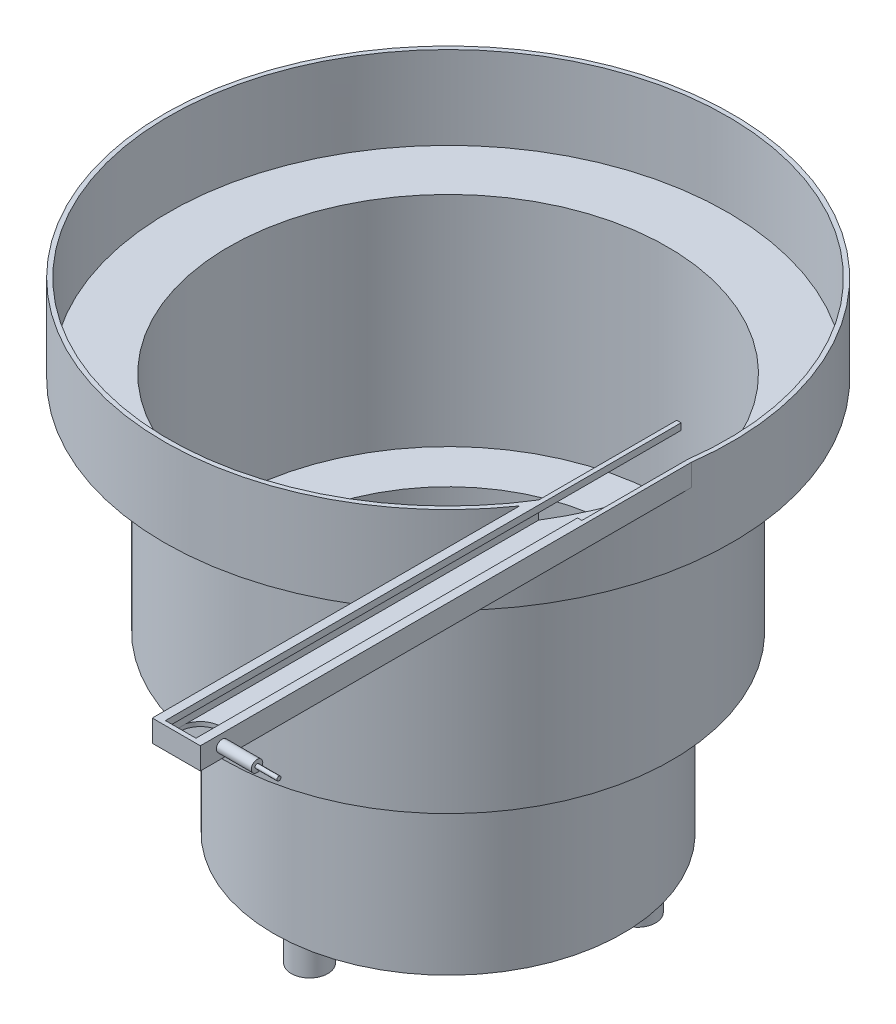
ISO-10303-21;
HEADER;
FILE_DESCRIPTION(('STEP AP214'),'2;1');
FILE_NAME('part.step','',(''),(''),'','','');
FILE_SCHEMA(('AUTOMOTIVE_DESIGN { 1 0 10303 214 1 1 1 1 }'));
ENDSEC;
DATA;
#1=APPLICATION_CONTEXT('core data for automotive mechanical design processes');
#2=APPLICATION_PROTOCOL_DEFINITION('international standard','automotive_design',2000,#1);
#3=PRODUCT_CONTEXT('',#1,'mechanical');
#4=PRODUCT('Part','Part','',(#3));
#5=PRODUCT_RELATED_PRODUCT_CATEGORY('part','',(#4));
#6=PRODUCT_DEFINITION_FORMATION('','',#4);
#7=PRODUCT_DEFINITION_CONTEXT('part definition',#1,'design');
#8=PRODUCT_DEFINITION('design','',#6,#7);
#9=PRODUCT_DEFINITION_SHAPE('','',#8);
#10=(LENGTH_UNIT() NAMED_UNIT(*) SI_UNIT(.MILLI.,.METRE.));
#11=(NAMED_UNIT(*) PLANE_ANGLE_UNIT() SI_UNIT($,.RADIAN.));
#12=(NAMED_UNIT(*) SI_UNIT($,.STERADIAN.) SOLID_ANGLE_UNIT());
#13=UNCERTAINTY_MEASURE_WITH_UNIT(LENGTH_MEASURE(1.E-05),#10,'distance_accuracy_value','');
#14=(GEOMETRIC_REPRESENTATION_CONTEXT(3) GLOBAL_UNCERTAINTY_ASSIGNED_CONTEXT((#13)) GLOBAL_UNIT_ASSIGNED_CONTEXT((#10,
#11,#12)) REPRESENTATION_CONTEXT('',''));
#15=CARTESIAN_POINT('',(0.,0.,0.));
#16=DIRECTION('',(0.,0.,1.));
#17=DIRECTION('',(1.,0.,0.));
#18=AXIS2_PLACEMENT_3D('',#15,#16,#17);
#19=CARTESIAN_POINT('',(144.842090500048,214.997371461664,232.319143826345));
#20=DIRECTION('',(1.,0.,0.));
#21=DIRECTION('',(0.,0.,-1.));
#22=AXIS2_PLACEMENT_3D('',#19,#20,#21);
#23=PLANE('',#22);
#24=CARTESIAN_POINT('',(144.842090500048,214.997371461664,232.319143826345));
#25=DIRECTION('',(1.,0.,0.));
#26=DIRECTION('',(0.,0.,-1.));
#27=AXIS2_PLACEMENT_3D('',#24,#25,#26);
#28=CIRCLE('',#27,2.6133198852535);
#29=CARTESIAN_POINT('',(144.842090500048,214.997371461664,229.705823941092));
#30=VERTEX_POINT('',#29);
#31=EDGE_CURVE('E179',#30,#30,#28,.T.);
#32=ORIENTED_EDGE('',*,*,#31,.T.);
#33=EDGE_LOOP('',(#32));
#34=FACE_BOUND('',#33,.T.);
#35=CARTESIAN_POINT('',(144.842090500048,214.997371461664,232.319143826345));
#36=DIRECTION('',(1.,0.,0.));
#37=DIRECTION('',(0.,0.,-1.));
#38=AXIS2_PLACEMENT_3D('',#35,#36,#37);
#39=CIRCLE('',#38,0.94118360123812);
#40=CARTESIAN_POINT('',(144.842090500048,214.997371461664,231.377960225107));
#41=VERTEX_POINT('',#40);
#42=EDGE_CURVE('E486',#41,#41,#39,.T.);
#43=ORIENTED_EDGE('',*,*,#42,.F.);
#44=EDGE_LOOP('',(#43));
#45=FACE_BOUND('',#44,.T.);
#46=ADVANCED_FACE('F38',(#34,#45),#23,.T.);
#47=CARTESIAN_POINT('',(128.842090500048,210.,1.44581984546799));
#48=DIRECTION('',(1.,0.,0.));
#49=DIRECTION('',(0.,0.,-1.));
#50=AXIS2_PLACEMENT_3D('',#47,#48,#49);
#51=PLANE('',#50);
#52=DIRECTION('',(0.,0.,-1.));
#53=VECTOR('',#52,1.);
#54=CARTESIAN_POINT('',(128.842090500048,220.,1.44581984546799));
#55=LINE('',#54,#53);
#56=CARTESIAN_POINT('',(128.842090500048,220.,242.28655443066));
#57=VERTEX_POINT('',#56);
#58=CARTESIAN_POINT('',(128.842090500048,220.,17.3122995462015));
#59=VERTEX_POINT('',#58);
#60=EDGE_CURVE('E222',#57,#59,#55,.T.);
#61=ORIENTED_EDGE('',*,*,#60,.F.);
#62=DIRECTION('',(0.,1.,0.));
#63=VECTOR('',#62,1.);
#64=CARTESIAN_POINT('',(128.842090500048,220.,242.28655443066));
#65=LINE('',#64,#63);
#66=CARTESIAN_POINT('',(128.842090500048,210.,242.28655443066));
#67=VERTEX_POINT('',#66);
#68=EDGE_CURVE('E341',#67,#57,#65,.T.);
#69=ORIENTED_EDGE('',*,*,#68,.F.);
#70=DIRECTION('',(0.,0.,-1.));
#71=VECTOR('',#70,1.);
#72=CARTESIAN_POINT('',(128.842090500048,210.,1.44581984546799));
#73=LINE('',#72,#71);
#74=CARTESIAN_POINT('',(128.842090500048,210.,17.3122995462015));
#75=VERTEX_POINT('',#74);
#76=EDGE_CURVE('E216',#67,#75,#73,.T.);
#77=ORIENTED_EDGE('',*,*,#76,.T.);
#78=DIRECTION('',(0.,-1.,0.));
#79=VECTOR('',#78,1.);
#80=CARTESIAN_POINT('',(128.842090500048,220.,17.3122995462015));
#81=LINE('',#80,#79);
#82=EDGE_CURVE('E228',#59,#75,#81,.T.);
#83=ORIENTED_EDGE('',*,*,#82,.F.);
#84=EDGE_LOOP('',(#61,#69,#77,#83));
#85=FACE_BOUND('',#84,.T.);
#86=CARTESIAN_POINT('',(128.842090500048,214.997371461664,232.319143826345));
#87=DIRECTION('',(1.,0.,0.));
#88=DIRECTION('',(0.,0.,-1.));
#89=AXIS2_PLACEMENT_3D('',#86,#87,#88);
#90=CIRCLE('',#89,2.6133198852535);
#91=CARTESIAN_POINT('',(128.842090500048,214.997371461664,229.705823941092));
#92=VERTEX_POINT('',#91);
#93=EDGE_CURVE('E481',#92,#92,#90,.T.);
#94=ORIENTED_EDGE('',*,*,#93,.F.);
#95=EDGE_LOOP('',(#94));
#96=FACE_BOUND('',#95,.T.);
#97=ADVANCED_FACE('F387',(#85,#96),#51,.T.);
#98=CARTESIAN_POINT('',(0.,212.,0.));
#99=DIRECTION('',(0.,-1.,0.));
#100=DIRECTION('',(0.,0.,-1.));
#101=AXIS2_PLACEMENT_3D('',#98,#99,#100);
#102=PLANE('',#101);
#103=DIRECTION('',(0.,0.,-1.));
#104=VECTOR('',#103,1.);
#105=CARTESIAN_POINT('',(126.842090500048,212.,1.44581984546799));
#106=LINE('',#105,#104);
#107=CARTESIAN_POINT('',(126.842090500048,212.,240.28655443066));
#108=VERTEX_POINT('',#107);
#109=CARTESIAN_POINT('',(126.842090500048,212.,233.845458790749));
#110=VERTEX_POINT('',#109);
#111=EDGE_CURVE('E185',#108,#110,#106,.T.);
#112=ORIENTED_EDGE('',*,*,#111,.T.);
#113=CARTESIAN_POINT('',(117.842090500048,212.,231.28655443066));
#114=DIRECTION('',(0.,1.,0.));
#115=DIRECTION('',(0.,0.,1.));
#116=AXIS2_PLACEMENT_3D('',#113,#114,#115);
#117=CIRCLE('',#116,9.35670837015266);
#118=CARTESIAN_POINT('',(120.400994860137,212.,240.28655443066));
#119=VERTEX_POINT('',#118);
#120=EDGE_CURVE('E177',#119,#110,#117,.T.);
#121=ORIENTED_EDGE('',*,*,#120,.F.);
#122=DIRECTION('',(1.,0.,0.));
#123=VECTOR('',#122,1.);
#124=CARTESIAN_POINT('',(128.842090500048,212.,240.28655443066));
#125=LINE('',#124,#123);
#126=EDGE_CURVE('E171',#119,#108,#125,.T.);
#127=ORIENTED_EDGE('',*,*,#126,.T.);
#128=EDGE_LOOP('',(#112,#121,#127));
#129=FACE_BOUND('',#128,.T.);
#130=ADVANCED_FACE('F183',(#129),#102,.F.);
#131=CARTESIAN_POINT('',(108.842090500048,212.,240.28655443066));
#132=VERTEX_POINT('',#131);
#133=CARTESIAN_POINT('',(115.283186139959,212.,240.28655443066));
#134=VERTEX_POINT('',#133);
#135=EDGE_CURVE('E170',#132,#134,#125,.T.);
#136=ORIENTED_EDGE('',*,*,#135,.T.);
#137=CARTESIAN_POINT('',(108.842090500048,212.,233.845458790749));
#138=VERTEX_POINT('',#137);
#139=EDGE_CURVE('E55',#138,#134,#117,.T.);
#140=ORIENTED_EDGE('',*,*,#139,.F.);
#141=DIRECTION('',(0.,0.,1.));
#142=VECTOR('',#141,1.);
#143=CARTESIAN_POINT('',(108.842090500048,212.,1.44581984546799));
#144=LINE('',#143,#142);
#145=EDGE_CURVE('E195',#138,#132,#144,.T.);
#146=ORIENTED_EDGE('',*,*,#145,.T.);
#147=EDGE_LOOP('',(#136,#140,#146));
#148=FACE_BOUND('',#147,.T.);
#149=ADVANCED_FACE('F593',(#148),#102,.F.);
#150=CARTESIAN_POINT('',(0.,0.,0.));
#151=DIRECTION('',(0.,1.,0.));
#152=DIRECTION('',(0.,0.,1.));
#153=AXIS2_PLACEMENT_3D('',#150,#151,#152);
#154=PLANE('',#153);
#155=CARTESIAN_POINT('',(-54.9316198527615,0.,-31.7147855090144));
#156=DIRECTION('',(0.,1.,0.));
#157=DIRECTION('',(0.,0.,1.));
#158=AXIS2_PLACEMENT_3D('',#155,#156,#157);
#159=CIRCLE('',#158,8.39932946770995);
#160=CARTESIAN_POINT('',(-54.9316198527615,0.,-23.3154560413045));
#161=VERTEX_POINT('',#160);
#162=EDGE_CURVE('E47',#161,#161,#159,.F.);
#163=ORIENTED_EDGE('',*,*,#162,.F.);
#164=EDGE_LOOP('',(#163));
#165=FACE_BOUND('',#164,.T.);
#166=CARTESIAN_POINT('',(0.,0.,0.));
#167=DIRECTION('',(0.,1.,0.));
#168=DIRECTION('',(0.,0.,1.));
#169=AXIS2_PLACEMENT_3D('',#166,#167,#168);
#170=CIRCLE('',#169,80.);
#171=CARTESIAN_POINT('',(0.,0.,80.));
#172=VERTEX_POINT('',#171);
#173=EDGE_CURVE('E241',#172,#172,#170,.T.);
#174=ORIENTED_EDGE('',*,*,#173,.F.);
#175=EDGE_LOOP('',(#174));
#176=FACE_BOUND('',#175,.T.);
#177=CARTESIAN_POINT('',(0.,0.,63.4295710180283));
#178=DIRECTION('',(0.,1.,0.));
#179=DIRECTION('',(0.,0.,1.));
#180=AXIS2_PLACEMENT_3D('',#177,#178,#179);
#181=CIRCLE('',#180,8.39932946770995);
#182=CARTESIAN_POINT('',(0.,0.,71.8289004857382));
#183=VERTEX_POINT('',#182);
#184=EDGE_CURVE('E252',#183,#183,#181,.F.);
#185=ORIENTED_EDGE('',*,*,#184,.F.);
#186=EDGE_LOOP('',(#185));
#187=FACE_BOUND('',#186,.T.);
#188=CARTESIAN_POINT('',(54.931619852762,0.,-31.7147855090136));
#189=DIRECTION('',(0.,1.,0.));
#190=DIRECTION('',(0.,0.,1.));
#191=AXIS2_PLACEMENT_3D('',#188,#189,#190);
#192=CIRCLE('',#191,8.39932946770995);
#193=CARTESIAN_POINT('',(54.931619852762,0.,-23.3154560413037));
#194=VERTEX_POINT('',#193);
#195=EDGE_CURVE('E11',#194,#194,#192,.F.);
#196=ORIENTED_EDGE('',*,*,#195,.F.);
#197=EDGE_LOOP('',(#196));
#198=FACE_BOUND('',#197,.T.);
#199=ADVANCED_FACE('F616',(#165,#176,#187,#198),#154,.F.);
#200=CARTESIAN_POINT('',(0.,80.,0.));
#201=DIRECTION('',(0.,-1.,0.));
#202=DIRECTION('',(0.,0.,-1.));
#203=AXIS2_PLACEMENT_3D('',#200,#201,#202);
#204=CYLINDRICAL_SURFACE('',#203,80.);
#205=CARTESIAN_POINT('',(0.,80.,0.));
#206=DIRECTION('',(0.,1.,0.));
#207=DIRECTION('',(0.,0.,1.));
#208=AXIS2_PLACEMENT_3D('',#205,#206,#207);
#209=CIRCLE('',#208,80.);
#210=CARTESIAN_POINT('',(0.,80.,80.));
#211=VERTEX_POINT('',#210);
#212=EDGE_CURVE('E244',#211,#211,#209,.T.);
#213=ORIENTED_EDGE('',*,*,#212,.F.);
#214=EDGE_LOOP('',(#213));
#215=FACE_BOUND('',#214,.T.);
#216=ORIENTED_EDGE('',*,*,#173,.T.);
#217=EDGE_LOOP('',(#216));
#218=FACE_BOUND('',#217,.T.);
#219=ADVANCED_FACE('F40',(#215,#218),#204,.T.);
#220=CARTESIAN_POINT('',(0.,80.,0.));
#221=DIRECTION('',(0.,1.,0.));
#222=DIRECTION('',(0.,0.,1.));
#223=AXIS2_PLACEMENT_3D('',#220,#221,#222);
#224=PLANE('',#223);
#225=CARTESIAN_POINT('',(0.,80.,0.));
#226=DIRECTION('',(0.,1.,0.));
#227=DIRECTION('',(0.,0.,1.));
#228=AXIS2_PLACEMENT_3D('',#225,#226,#227);
#229=CIRCLE('',#228,102.5);
#230=CARTESIAN_POINT('',(0.,80.,102.5));
#231=VERTEX_POINT('',#230);
#232=EDGE_CURVE('E235',#231,#231,#229,.T.);
#233=ORIENTED_EDGE('',*,*,#232,.F.);
#234=EDGE_LOOP('',(#233));
#235=FACE_BOUND('',#234,.T.);
#236=ORIENTED_EDGE('',*,*,#212,.T.);
#237=EDGE_LOOP('',(#236));
#238=FACE_BOUND('',#237,.T.);
#239=ADVANCED_FACE('F828',(#235,#238),#224,.F.);
#240=CARTESIAN_POINT('',(0.,180.,0.));
#241=DIRECTION('',(0.,-1.,0.));
#242=DIRECTION('',(0.,0.,-1.));
#243=AXIS2_PLACEMENT_3D('',#240,#241,#242);
#244=CYLINDRICAL_SURFACE('',#243,102.5);
#245=CARTESIAN_POINT('',(0.,180.,0.));
#246=DIRECTION('',(0.,1.,0.));
#247=DIRECTION('',(0.,0.,1.));
#248=AXIS2_PLACEMENT_3D('',#245,#246,#247);
#249=CIRCLE('',#248,102.5);
#250=CARTESIAN_POINT('',(0.,180.,102.5));
#251=VERTEX_POINT('',#250);
#252=EDGE_CURVE('E238',#251,#251,#249,.T.);
#253=ORIENTED_EDGE('',*,*,#252,.F.);
#254=EDGE_LOOP('',(#253));
#255=FACE_BOUND('',#254,.T.);
#256=ORIENTED_EDGE('',*,*,#232,.T.);
#257=EDGE_LOOP('',(#256));
#258=FACE_BOUND('',#257,.T.);
#259=ADVANCED_FACE('F818',(#255,#258),#244,.T.);
#260=CARTESIAN_POINT('',(0.,180.,0.));
#261=DIRECTION('',(0.,1.,0.));
#262=DIRECTION('',(0.,0.,1.));
#263=AXIS2_PLACEMENT_3D('',#260,#261,#262);
#264=PLANE('',#263);
#265=CARTESIAN_POINT('',(0.,180.,0.));
#266=DIRECTION('',(0.,1.,0.));
#267=DIRECTION('',(0.,0.,1.));
#268=AXIS2_PLACEMENT_3D('',#265,#266,#267);
#269=CIRCLE('',#268,130.);
#270=CARTESIAN_POINT('',(0.,180.,130.));
#271=VERTEX_POINT('',#270);
#272=EDGE_CURVE('E231',#271,#271,#269,.T.);
#273=ORIENTED_EDGE('',*,*,#272,.F.);
#274=EDGE_LOOP('',(#273));
#275=FACE_BOUND('',#274,.T.);
#276=ORIENTED_EDGE('',*,*,#252,.T.);
#277=EDGE_LOOP('',(#276));
#278=FACE_BOUND('',#277,.T.);
#279=ADVANCED_FACE('F808',(#275,#278),#264,.F.);
#280=CARTESIAN_POINT('',(0.,220.,0.));
#281=DIRECTION('',(0.,-1.,0.));
#282=DIRECTION('',(0.,0.,-1.));
#283=AXIS2_PLACEMENT_3D('',#280,#281,#282);
#284=CYLINDRICAL_SURFACE('',#283,130.);
#285=CARTESIAN_POINT('',(0.,220.,0.));
#286=DIRECTION('',(0.,1.,0.));
#287=DIRECTION('',(0.,0.,1.));
#288=AXIS2_PLACEMENT_3D('',#285,#286,#287);
#289=CIRCLE('',#288,130.);
#290=CARTESIAN_POINT('',(106.842090500048,220.,74.0592175058549));
#291=VERTEX_POINT('',#290);
#292=EDGE_CURVE('E232',#59,#291,#289,.T.);
#293=ORIENTED_EDGE('',*,*,#292,.F.);
#294=ORIENTED_EDGE('',*,*,#82,.T.);
#295=CARTESIAN_POINT('',(0.,210.,0.));
#296=DIRECTION('',(0.,-1.,0.));
#297=DIRECTION('',(0.,0.,-1.));
#298=AXIS2_PLACEMENT_3D('',#295,#296,#297);
#299=CIRCLE('',#298,130.);
#300=CARTESIAN_POINT('',(106.842090500048,210.,74.0592175058549));
#301=VERTEX_POINT('',#300);
#302=EDGE_CURVE('E247',#75,#301,#299,.T.);
#303=ORIENTED_EDGE('',*,*,#302,.T.);
#304=DIRECTION('',(0.,-1.,0.));
#305=VECTOR('',#304,1.);
#306=CARTESIAN_POINT('',(106.842090500048,220.,74.0592175058549));
#307=LINE('',#306,#305);
#308=EDGE_CURVE('E221',#301,#291,#307,.F.);
#309=ORIENTED_EDGE('',*,*,#308,.T.);
#310=EDGE_LOOP('',(#293,#294,#303,#309));
#311=FACE_BOUND('',#310,.T.);
#312=ORIENTED_EDGE('',*,*,#272,.T.);
#313=EDGE_LOOP('',(#312));
#314=FACE_BOUND('',#313,.T.);
#315=ADVANCED_FACE('F473',(#311,#314),#284,.T.);
#316=CARTESIAN_POINT('',(0.,220.,0.));
#317=DIRECTION('',(0.,1.,0.));
#318=DIRECTION('',(0.,0.,1.));
#319=AXIS2_PLACEMENT_3D('',#316,#317,#318);
#320=PLANE('',#319);
#321=DIRECTION('',(0.,0.,1.));
#322=VECTOR('',#321,1.);
#323=CARTESIAN_POINT('',(124.842090500048,220.,240.28655443066));
#324=LINE('',#323,#322);
#325=CARTESIAN_POINT('',(124.842090500048,220.,65.5909477668257));
#326=VERTEX_POINT('',#325);
#327=CARTESIAN_POINT('',(124.842090500048,220.,240.28655443066));
#328=VERTEX_POINT('',#327);
#329=EDGE_CURVE('E337',#326,#328,#324,.T.);
#330=ORIENTED_EDGE('',*,*,#329,.T.);
#331=DIRECTION('',(-1.,0.,0.));
#332=VECTOR('',#331,1.);
#333=CARTESIAN_POINT('',(106.842090500048,220.,240.28655443066));
#334=LINE('',#333,#332);
#335=CARTESIAN_POINT('',(110.842090500048,220.,240.28655443066));
#336=VERTEX_POINT('',#335);
#337=EDGE_CURVE('E371',#328,#336,#334,.T.);
#338=ORIENTED_EDGE('',*,*,#337,.T.);
#339=DIRECTION('',(0.,0.,-1.));
#340=VECTOR('',#339,1.);
#341=CARTESIAN_POINT('',(110.842090500048,220.,240.28655443066));
#342=LINE('',#341,#340);
#343=CARTESIAN_POINT('',(110.842090500048,220.,4.14846862858242));
#344=VERTEX_POINT('',#343);
#345=EDGE_CURVE('E257',#336,#344,#342,.T.);
#346=ORIENTED_EDGE('',*,*,#345,.T.);
#347=DIRECTION('',(-1.,0.,0.));
#348=VECTOR('',#347,1.);
#349=CARTESIAN_POINT('',(108.842090500048,220.,4.14846862858242));
#350=LINE('',#349,#348);
#351=CARTESIAN_POINT('',(108.842090500048,220.,4.14846862858242));
#352=VERTEX_POINT('',#351);
#353=EDGE_CURVE('E260',#344,#352,#350,.T.);
#354=ORIENTED_EDGE('',*,*,#353,.T.);
#355=DIRECTION('',(0.,0.,1.));
#356=VECTOR('',#355,1.);
#357=CARTESIAN_POINT('',(108.842090500048,220.,240.28655443066));
#358=LINE('',#357,#356);
#359=CARTESIAN_POINT('',(108.842090500048,220.,67.3602207209814));
#360=VERTEX_POINT('',#359);
#361=EDGE_CURVE('E261',#352,#360,#358,.T.);
#362=ORIENTED_EDGE('',*,*,#361,.T.);
#363=CARTESIAN_POINT('',(0.,220.,0.));
#364=DIRECTION('',(0.,1.,0.));
#365=DIRECTION('',(0.,0.,1.));
#366=AXIS2_PLACEMENT_3D('',#363,#364,#365);
#367=CIRCLE('',#366,128.);
#368=CARTESIAN_POINT('',(126.842090500048,220.,17.1780114558583));
#369=VERTEX_POINT('',#368);
#370=EDGE_CURVE('E207',#369,#360,#367,.T.);
#371=ORIENTED_EDGE('',*,*,#370,.F.);
#372=DIRECTION('',(0.,0.,-1.));
#373=VECTOR('',#372,1.);
#374=CARTESIAN_POINT('',(126.842090500048,220.,0.));
#375=LINE('',#374,#373);
#376=CARTESIAN_POINT('',(126.842090500048,220.,65.5909477668257));
#377=VERTEX_POINT('',#376);
#378=EDGE_CURVE('E212',#377,#369,#375,.T.);
#379=ORIENTED_EDGE('',*,*,#378,.F.);
#380=DIRECTION('',(-1.,0.,0.));
#381=VECTOR('',#380,1.);
#382=CARTESIAN_POINT('',(126.842090500048,220.,65.5909477668257));
#383=LINE('',#382,#381);
#384=EDGE_CURVE('E329',#377,#326,#383,.T.);
#385=ORIENTED_EDGE('',*,*,#384,.T.);
#386=EDGE_LOOP('',(#330,#338,#346,#354,#362,#371,#379,#385));
#387=FACE_BOUND('',#386,.T.);
#388=DIRECTION('',(-1.,0.,0.));
#389=VECTOR('',#388,1.);
#390=CARTESIAN_POINT('',(106.842090500048,220.,242.28655443066));
#391=LINE('',#390,#389);
#392=CARTESIAN_POINT('',(106.842090500048,220.,242.28655443066));
#393=VERTEX_POINT('',#392);
#394=EDGE_CURVE('E338',#57,#393,#391,.T.);
#395=ORIENTED_EDGE('',*,*,#394,.F.);
#396=ORIENTED_EDGE('',*,*,#60,.T.);
#397=ORIENTED_EDGE('',*,*,#292,.T.);
#398=DIRECTION('',(0.,0.,1.));
#399=VECTOR('',#398,1.);
#400=CARTESIAN_POINT('',(106.842090500048,220.,1.44581984546799));
#401=LINE('',#400,#399);
#402=EDGE_CURVE('E219',#291,#393,#401,.T.);
#403=ORIENTED_EDGE('',*,*,#402,.T.);
#404=EDGE_LOOP('',(#395,#396,#397,#403));
#405=FACE_BOUND('',#404,.T.);
#406=ADVANCED_FACE('F327',(#387,#405),#320,.T.);
#407=CARTESIAN_POINT('',(0.,210.,0.));
#408=DIRECTION('',(0.,-1.,0.));
#409=DIRECTION('',(0.,0.,-1.));
#410=AXIS2_PLACEMENT_3D('',#407,#408,#409);
#411=PLANE('',#410);
#412=CARTESIAN_POINT('',(117.842090500048,210.,231.28655443066));
#413=DIRECTION('',(0.,-1.,0.));
#414=DIRECTION('',(0.,0.,-1.));
#415=AXIS2_PLACEMENT_3D('',#412,#413,#414);
#416=CIRCLE('',#415,9.35670837015266);
#417=CARTESIAN_POINT('',(117.842090500048,210.,221.929846060507));
#418=VERTEX_POINT('',#417);
#419=EDGE_CURVE('E441',#418,#418,#416,.T.);
#420=ORIENTED_EDGE('',*,*,#419,.F.);
#421=EDGE_LOOP('',(#420));
#422=FACE_BOUND('',#421,.T.);
#423=ORIENTED_EDGE('',*,*,#76,.F.);
#424=DIRECTION('',(1.,0.,0.));
#425=VECTOR('',#424,1.);
#426=CARTESIAN_POINT('',(106.842090500048,210.,242.28655443066));
#427=LINE('',#426,#425);
#428=CARTESIAN_POINT('',(106.842090500048,210.,242.28655443066));
#429=VERTEX_POINT('',#428);
#430=EDGE_CURVE('E450',#429,#67,#427,.T.);
#431=ORIENTED_EDGE('',*,*,#430,.F.);
#432=DIRECTION('',(0.,0.,1.));
#433=VECTOR('',#432,1.);
#434=CARTESIAN_POINT('',(106.842090500048,210.,1.44581984546799));
#435=LINE('',#434,#433);
#436=EDGE_CURVE('E218',#301,#429,#435,.T.);
#437=ORIENTED_EDGE('',*,*,#436,.F.);
#438=ORIENTED_EDGE('',*,*,#302,.F.);
#439=EDGE_LOOP('',(#423,#431,#437,#438));
#440=FACE_BOUND('',#439,.T.);
#441=ADVANCED_FACE('F477',(#422,#440),#411,.T.);
#442=CARTESIAN_POINT('',(106.842090500048,210.,1.44581984546799));
#443=DIRECTION('',(-1.,0.,0.));
#444=DIRECTION('',(0.,0.,1.));
#445=AXIS2_PLACEMENT_3D('',#442,#443,#444);
#446=PLANE('',#445);
#447=ORIENTED_EDGE('',*,*,#436,.T.);
#448=DIRECTION('',(0.,-1.,0.));
#449=VECTOR('',#448,1.);
#450=CARTESIAN_POINT('',(106.842090500048,220.,242.28655443066));
#451=LINE('',#450,#449);
#452=EDGE_CURVE('E447',#393,#429,#451,.T.);
#453=ORIENTED_EDGE('',*,*,#452,.F.);
#454=ORIENTED_EDGE('',*,*,#402,.F.);
#455=ORIENTED_EDGE('',*,*,#308,.F.);
#456=EDGE_LOOP('',(#447,#453,#454,#455));
#457=FACE_BOUND('',#456,.T.);
#458=ADVANCED_FACE('F470',(#457),#446,.T.);
#459=CARTESIAN_POINT('',(0.,80.,0.));
#460=DIRECTION('',(0.,-1.,0.));
#461=DIRECTION('',(0.,0.,-1.));
#462=AXIS2_PLACEMENT_3D('',#459,#460,#461);
#463=CYLINDRICAL_SURFACE('',#462,78.);
#464=CARTESIAN_POINT('',(0.,82.,0.));
#465=DIRECTION('',(0.,1.,0.));
#466=DIRECTION('',(0.,0.,1.));
#467=AXIS2_PLACEMENT_3D('',#464,#465,#466);
#468=CIRCLE('',#467,78.);
#469=CARTESIAN_POINT('',(0.,82.,78.));
#470=VERTEX_POINT('',#469);
#471=EDGE_CURVE('E287',#470,#470,#468,.T.);
#472=ORIENTED_EDGE('',*,*,#471,.T.);
#473=EDGE_LOOP('',(#472));
#474=FACE_BOUND('',#473,.T.);
#475=CARTESIAN_POINT('',(0.,2.,0.));
#476=DIRECTION('',(0.,1.,0.));
#477=DIRECTION('',(0.,0.,1.));
#478=AXIS2_PLACEMENT_3D('',#475,#476,#477);
#479=CIRCLE('',#478,78.);
#480=CARTESIAN_POINT('',(0.,2.,78.));
#481=VERTEX_POINT('',#480);
#482=EDGE_CURVE('E290',#481,#481,#479,.T.);
#483=ORIENTED_EDGE('',*,*,#482,.F.);
#484=EDGE_LOOP('',(#483));
#485=FACE_BOUND('',#484,.T.);
#486=ADVANCED_FACE('F657',(#474,#485),#463,.F.);
#487=CARTESIAN_POINT('',(0.,2.,0.));
#488=DIRECTION('',(0.,1.,0.));
#489=DIRECTION('',(0.,0.,1.));
#490=AXIS2_PLACEMENT_3D('',#487,#488,#489);
#491=PLANE('',#490);
#492=ORIENTED_EDGE('',*,*,#482,.T.);
#493=EDGE_LOOP('',(#492));
#494=FACE_BOUND('',#493,.T.);
#495=ADVANCED_FACE('F782',(#494),#491,.T.);
#496=CARTESIAN_POINT('',(0.,82.,0.));
#497=DIRECTION('',(0.,1.,0.));
#498=DIRECTION('',(0.,0.,1.));
#499=AXIS2_PLACEMENT_3D('',#496,#497,#498);
#500=PLANE('',#499);
#501=CARTESIAN_POINT('',(0.,82.,0.));
#502=DIRECTION('',(0.,1.,0.));
#503=DIRECTION('',(0.,0.,1.));
#504=AXIS2_PLACEMENT_3D('',#501,#502,#503);
#505=CIRCLE('',#504,100.5);
#506=CARTESIAN_POINT('',(0.,82.,100.5));
#507=VERTEX_POINT('',#506);
#508=EDGE_CURVE('E210',#507,#507,#505,.T.);
#509=ORIENTED_EDGE('',*,*,#508,.T.);
#510=EDGE_LOOP('',(#509));
#511=FACE_BOUND('',#510,.T.);
#512=ORIENTED_EDGE('',*,*,#471,.F.);
#513=EDGE_LOOP('',(#512));
#514=FACE_BOUND('',#513,.T.);
#515=ADVANCED_FACE('F772',(#511,#514),#500,.T.);
#516=CARTESIAN_POINT('',(0.,180.,0.));
#517=DIRECTION('',(0.,-1.,0.));
#518=DIRECTION('',(0.,0.,-1.));
#519=AXIS2_PLACEMENT_3D('',#516,#517,#518);
#520=CYLINDRICAL_SURFACE('',#519,100.5);
#521=CARTESIAN_POINT('',(0.,182.,0.));
#522=DIRECTION('',(0.,1.,0.));
#523=DIRECTION('',(0.,0.,1.));
#524=AXIS2_PLACEMENT_3D('',#521,#522,#523);
#525=CIRCLE('',#524,100.5);
#526=CARTESIAN_POINT('',(0.,182.,100.5));
#527=VERTEX_POINT('',#526);
#528=EDGE_CURVE('E293',#527,#527,#525,.T.);
#529=ORIENTED_EDGE('',*,*,#528,.T.);
#530=EDGE_LOOP('',(#529));
#531=FACE_BOUND('',#530,.T.);
#532=ORIENTED_EDGE('',*,*,#508,.F.);
#533=EDGE_LOOP('',(#532));
#534=FACE_BOUND('',#533,.T.);
#535=ADVANCED_FACE('F762',(#531,#534),#520,.F.);
#536=CARTESIAN_POINT('',(0.,182.,0.));
#537=DIRECTION('',(0.,1.,0.));
#538=DIRECTION('',(0.,0.,1.));
#539=AXIS2_PLACEMENT_3D('',#536,#537,#538);
#540=PLANE('',#539);
#541=CARTESIAN_POINT('',(0.,182.,0.));
#542=DIRECTION('',(0.,1.,0.));
#543=DIRECTION('',(0.,0.,1.));
#544=AXIS2_PLACEMENT_3D('',#541,#542,#543);
#545=CIRCLE('',#544,128.);
#546=CARTESIAN_POINT('',(0.,182.,128.));
#547=VERTEX_POINT('',#546);
#548=EDGE_CURVE('E211',#547,#547,#545,.T.);
#549=ORIENTED_EDGE('',*,*,#548,.T.);
#550=EDGE_LOOP('',(#549));
#551=FACE_BOUND('',#550,.T.);
#552=ORIENTED_EDGE('',*,*,#528,.F.);
#553=EDGE_LOOP('',(#552));
#554=FACE_BOUND('',#553,.T.);
#555=ADVANCED_FACE('F689',(#551,#554),#540,.T.);
#556=CARTESIAN_POINT('',(0.,220.,0.));
#557=DIRECTION('',(0.,-1.,0.));
#558=DIRECTION('',(0.,0.,-1.));
#559=AXIS2_PLACEMENT_3D('',#556,#557,#558);
#560=CYLINDRICAL_SURFACE('',#559,128.);
#561=ORIENTED_EDGE('',*,*,#370,.T.);
#562=DIRECTION('',(0.,-1.,0.));
#563=VECTOR('',#562,1.);
#564=CARTESIAN_POINT('',(108.842090500048,220.,67.3602207209813));
#565=LINE('',#564,#563);
#566=CARTESIAN_POINT('',(108.842090500048,217.,67.3602207209814));
#567=VERTEX_POINT('',#566);
#568=EDGE_CURVE('E276',#567,#360,#565,.F.);
#569=ORIENTED_EDGE('',*,*,#568,.F.);
#570=DIRECTION('',(0.,-1.,0.));
#571=VECTOR('',#570,1.);
#572=CARTESIAN_POINT('',(108.842090500048,212.,67.3602207209814));
#573=LINE('',#572,#571);
#574=CARTESIAN_POINT('',(108.842090500048,212.,67.3602207209814));
#575=VERTEX_POINT('',#574);
#576=EDGE_CURVE('E204',#575,#567,#573,.F.);
#577=ORIENTED_EDGE('',*,*,#576,.F.);
#578=CARTESIAN_POINT('',(0.,212.,0.));
#579=DIRECTION('',(0.,-1.,0.));
#580=DIRECTION('',(0.,0.,-1.));
#581=AXIS2_PLACEMENT_3D('',#578,#579,#580);
#582=CIRCLE('',#581,128.);
#583=CARTESIAN_POINT('',(126.842090500048,212.,17.1780114558583));
#584=VERTEX_POINT('',#583);
#585=EDGE_CURVE('E224',#584,#575,#582,.T.);
#586=ORIENTED_EDGE('',*,*,#585,.F.);
#587=DIRECTION('',(0.,-1.,0.));
#588=VECTOR('',#587,1.);
#589=CARTESIAN_POINT('',(126.842090500048,220.,17.1780114558583));
#590=LINE('',#589,#588);
#591=EDGE_CURVE('E300',#369,#584,#590,.T.);
#592=ORIENTED_EDGE('',*,*,#591,.F.);
#593=EDGE_LOOP('',(#561,#569,#577,#586,#592));
#594=FACE_BOUND('',#593,.T.);
#595=ORIENTED_EDGE('',*,*,#548,.F.);
#596=EDGE_LOOP('',(#595));
#597=FACE_BOUND('',#596,.T.);
#598=ADVANCED_FACE('F315',(#594,#597),#560,.F.);
#599=CARTESIAN_POINT('',(108.842090500048,212.,228.72765007057));
#600=VERTEX_POINT('',#599);
#601=EDGE_CURVE('E193',#575,#600,#144,.T.);
#602=ORIENTED_EDGE('',*,*,#601,.T.);
#603=CARTESIAN_POINT('',(126.842090500048,212.,228.72765007057));
#604=VERTEX_POINT('',#603);
#605=EDGE_CURVE('E312',#604,#600,#117,.T.);
#606=ORIENTED_EDGE('',*,*,#605,.F.);
#607=EDGE_CURVE('E214',#604,#584,#106,.T.);
#608=ORIENTED_EDGE('',*,*,#607,.T.);
#609=ORIENTED_EDGE('',*,*,#585,.T.);
#610=EDGE_LOOP('',(#602,#606,#608,#609));
#611=FACE_BOUND('',#610,.T.);
#612=ADVANCED_FACE('F310',(#611),#102,.F.);
#613=CARTESIAN_POINT('',(126.842090500048,210.,1.44581984546799));
#614=DIRECTION('',(1.,0.,0.));
#615=DIRECTION('',(0.,0.,-1.));
#616=AXIS2_PLACEMENT_3D('',#613,#614,#615);
#617=PLANE('',#616);
#618=DIRECTION('',(0.,0.,-1.));
#619=VECTOR('',#618,1.);
#620=CARTESIAN_POINT('',(126.842090500048,217.,240.28655443066));
#621=LINE('',#620,#619);
#622=CARTESIAN_POINT('',(126.842090500048,217.,240.28655443066));
#623=VERTEX_POINT('',#622);
#624=CARTESIAN_POINT('',(126.842090500048,217.,65.5909477668257));
#625=VERTEX_POINT('',#624);
#626=EDGE_CURVE('E63',#623,#625,#621,.T.);
#627=ORIENTED_EDGE('',*,*,#626,.T.);
#628=DIRECTION('',(0.,1.,0.));
#629=VECTOR('',#628,1.);
#630=CARTESIAN_POINT('',(126.842090500048,217.,65.5909477668257));
#631=LINE('',#630,#629);
#632=EDGE_CURVE('E322',#625,#377,#631,.T.);
#633=ORIENTED_EDGE('',*,*,#632,.T.);
#634=ORIENTED_EDGE('',*,*,#378,.T.);
#635=ORIENTED_EDGE('',*,*,#591,.T.);
#636=ORIENTED_EDGE('',*,*,#607,.F.);
#637=DIRECTION('',(0.,0.,1.));
#638=VECTOR('',#637,1.);
#639=CARTESIAN_POINT('',(126.842090500048,212.,1.44581984546799));
#640=LINE('',#639,#638);
#641=EDGE_CURVE('E439',#604,#110,#640,.T.);
#642=ORIENTED_EDGE('',*,*,#641,.T.);
#643=ORIENTED_EDGE('',*,*,#111,.F.);
#644=DIRECTION('',(0.,1.,0.));
#645=VECTOR('',#644,1.);
#646=CARTESIAN_POINT('',(126.842090500048,210.,240.28655443066));
#647=LINE('',#646,#645);
#648=EDGE_CURVE('E192',#108,#623,#647,.T.);
#649=ORIENTED_EDGE('',*,*,#648,.T.);
#650=EDGE_LOOP('',(#627,#633,#634,#635,#636,#642,#643,#649));
#651=FACE_BOUND('',#650,.T.);
#652=ADVANCED_FACE('F320',(#651),#617,.F.);
#653=CARTESIAN_POINT('',(108.842090500048,210.,1.44581984546799));
#654=DIRECTION('',(-1.,0.,0.));
#655=DIRECTION('',(0.,0.,1.));
#656=AXIS2_PLACEMENT_3D('',#653,#654,#655);
#657=PLANE('',#656);
#658=ORIENTED_EDGE('',*,*,#576,.T.);
#659=DIRECTION('',(0.,0.,1.));
#660=VECTOR('',#659,1.);
#661=CARTESIAN_POINT('',(108.842090500048,217.,240.28655443066));
#662=LINE('',#661,#660);
#663=CARTESIAN_POINT('',(108.842090500048,217.,240.28655443066));
#664=VERTEX_POINT('',#663);
#665=EDGE_CURVE('E353',#567,#664,#662,.T.);
#666=ORIENTED_EDGE('',*,*,#665,.T.);
#667=DIRECTION('',(0.,1.,0.));
#668=VECTOR('',#667,1.);
#669=CARTESIAN_POINT('',(108.842090500048,210.,240.28655443066));
#670=LINE('',#669,#668);
#671=EDGE_CURVE('E198',#132,#664,#670,.T.);
#672=ORIENTED_EDGE('',*,*,#671,.F.);
#673=ORIENTED_EDGE('',*,*,#145,.F.);
#674=DIRECTION('',(0.,0.,-1.));
#675=VECTOR('',#674,1.);
#676=CARTESIAN_POINT('',(108.842090500048,212.,1.44581984546799));
#677=LINE('',#676,#675);
#678=EDGE_CURVE('E186',#138,#600,#677,.T.);
#679=ORIENTED_EDGE('',*,*,#678,.T.);
#680=ORIENTED_EDGE('',*,*,#601,.F.);
#681=EDGE_LOOP('',(#658,#666,#672,#673,#679,#680));
#682=FACE_BOUND('',#681,.T.);
#683=ADVANCED_FACE('F435',(#682),#657,.F.);
#684=CARTESIAN_POINT('',(0.,-20.,63.4295710180283));
#685=DIRECTION('',(0.,1.,0.));
#686=DIRECTION('',(0.,0.,1.));
#687=AXIS2_PLACEMENT_3D('',#684,#685,#686);
#688=CYLINDRICAL_SURFACE('',#687,8.39932946770995);
#689=CARTESIAN_POINT('',(0.,-20.,63.4295710180283));
#690=DIRECTION('',(0.,-1.,0.));
#691=DIRECTION('',(0.,0.,-1.));
#692=AXIS2_PLACEMENT_3D('',#689,#690,#691);
#693=CIRCLE('',#692,8.39932946770995);
#694=CARTESIAN_POINT('',(0.,-20.,55.0302415503183));
#695=VERTEX_POINT('',#694);
#696=EDGE_CURVE('E215',#695,#695,#693,.T.);
#697=ORIENTED_EDGE('',*,*,#696,.F.);
#698=EDGE_LOOP('',(#697));
#699=FACE_BOUND('',#698,.T.);
#700=ORIENTED_EDGE('',*,*,#184,.T.);
#701=EDGE_LOOP('',(#700));
#702=FACE_BOUND('',#701,.T.);
#703=ADVANCED_FACE('F573',(#699,#702),#688,.T.);
#704=CARTESIAN_POINT('',(0.,-20.,63.4295710180283));
#705=DIRECTION('',(0.,-1.,0.));
#706=DIRECTION('',(0.,0.,-1.));
#707=AXIS2_PLACEMENT_3D('',#704,#705,#706);
#708=PLANE('',#707);
#709=ORIENTED_EDGE('',*,*,#696,.T.);
#710=EDGE_LOOP('',(#709));
#711=FACE_BOUND('',#710,.T.);
#712=ADVANCED_FACE('F730',(#711),#708,.T.);
#713=CARTESIAN_POINT('',(-54.9316198527615,-20.,-31.7147855090144));
#714=DIRECTION('',(0.,1.,0.));
#715=DIRECTION('',(0.,0.,1.));
#716=AXIS2_PLACEMENT_3D('',#713,#714,#715);
#717=CYLINDRICAL_SURFACE('',#716,8.39932946770995);
#718=CARTESIAN_POINT('',(-54.9316198527615,-20.,-31.7147855090144));
#719=DIRECTION('',(0.,-1.,0.));
#720=DIRECTION('',(0.866025403784436,0.,0.500000000000004));
#721=AXIS2_PLACEMENT_3D('',#718,#719,#720);
#722=CIRCLE('',#721,8.39932946770995);
#723=CARTESIAN_POINT('',(-47.6575871589695,-20.,-27.5151207751594));
#724=VERTEX_POINT('',#723);
#725=EDGE_CURVE('E282',#724,#724,#722,.T.);
#726=ORIENTED_EDGE('',*,*,#725,.F.);
#727=EDGE_LOOP('',(#726));
#728=FACE_BOUND('',#727,.T.);
#729=ORIENTED_EDGE('',*,*,#162,.T.);
#730=EDGE_LOOP('',(#729));
#731=FACE_BOUND('',#730,.T.);
#732=ADVANCED_FACE('F720',(#728,#731),#717,.T.);
#733=CARTESIAN_POINT('',(-54.9316198527615,-20.,-31.7147855090144));
#734=DIRECTION('',(0.,-1.,0.));
#735=DIRECTION('',(0.866025403784436,0.,0.500000000000004));
#736=AXIS2_PLACEMENT_3D('',#733,#734,#735);
#737=PLANE('',#736);
#738=ORIENTED_EDGE('',*,*,#725,.T.);
#739=EDGE_LOOP('',(#738));
#740=FACE_BOUND('',#739,.T.);
#741=ADVANCED_FACE('F710',(#740),#737,.T.);
#742=CARTESIAN_POINT('',(54.931619852762,-20.,-31.7147855090136));
#743=DIRECTION('',(0.,1.,0.));
#744=DIRECTION('',(0.,0.,1.));
#745=AXIS2_PLACEMENT_3D('',#742,#743,#744);
#746=CYLINDRICAL_SURFACE('',#745,8.39932946770995);
#747=CARTESIAN_POINT('',(54.931619852762,-20.,-31.7147855090136));
#748=DIRECTION('',(0.,-1.,0.));
#749=DIRECTION('',(-0.866025403784443,0.,0.499999999999992));
#750=AXIS2_PLACEMENT_3D('',#747,#748,#749);
#751=CIRCLE('',#750,8.39932946770995);
#752=CARTESIAN_POINT('',(47.6575871589699,-20.,-27.5151207751587));
#753=VERTEX_POINT('',#752);
#754=EDGE_CURVE('E278',#753,#753,#751,.T.);
#755=ORIENTED_EDGE('',*,*,#754,.F.);
#756=EDGE_LOOP('',(#755));
#757=FACE_BOUND('',#756,.T.);
#758=ORIENTED_EDGE('',*,*,#195,.T.);
#759=EDGE_LOOP('',(#758));
#760=FACE_BOUND('',#759,.T.);
#761=ADVANCED_FACE('F699',(#757,#760),#746,.T.);
#762=CARTESIAN_POINT('',(54.931619852762,-20.,-31.7147855090136));
#763=DIRECTION('',(0.,-1.,0.));
#764=DIRECTION('',(-0.866025403784443,0.,0.499999999999992));
#765=AXIS2_PLACEMENT_3D('',#762,#763,#764);
#766=PLANE('',#765);
#767=ORIENTED_EDGE('',*,*,#754,.T.);
#768=EDGE_LOOP('',(#767));
#769=FACE_BOUND('',#768,.T.);
#770=ADVANCED_FACE('F382',(#769),#766,.T.);
#771=CARTESIAN_POINT('',(108.842090500048,217.,240.28655443066));
#772=DIRECTION('',(-1.,0.,0.));
#773=DIRECTION('',(0.,0.,1.));
#774=AXIS2_PLACEMENT_3D('',#771,#772,#773);
#775=PLANE('',#774);
#776=CARTESIAN_POINT('',(108.842090500048,217.,4.14846862858242));
#777=VERTEX_POINT('',#776);
#778=EDGE_CURVE('E349',#777,#567,#662,.T.);
#779=ORIENTED_EDGE('',*,*,#778,.T.);
#780=ORIENTED_EDGE('',*,*,#568,.T.);
#781=ORIENTED_EDGE('',*,*,#361,.F.);
#782=DIRECTION('',(0.,1.,0.));
#783=VECTOR('',#782,1.);
#784=CARTESIAN_POINT('',(108.842090500048,217.,4.14846862858242));
#785=LINE('',#784,#783);
#786=EDGE_CURVE('E279',#777,#352,#785,.T.);
#787=ORIENTED_EDGE('',*,*,#786,.F.);
#788=EDGE_LOOP('',(#779,#780,#781,#787));
#789=FACE_BOUND('',#788,.T.);
#790=ADVANCED_FACE('F374',(#789),#775,.T.);
#791=CARTESIAN_POINT('',(108.842090500048,217.,4.14846862858242));
#792=DIRECTION('',(0.,0.,-1.));
#793=DIRECTION('',(-1.,0.,0.));
#794=AXIS2_PLACEMENT_3D('',#791,#792,#793);
#795=PLANE('',#794);
#796=ORIENTED_EDGE('',*,*,#353,.F.);
#797=DIRECTION('',(0.,1.,0.));
#798=VECTOR('',#797,1.);
#799=CARTESIAN_POINT('',(110.842090500048,217.,4.14846862858242));
#800=LINE('',#799,#798);
#801=CARTESIAN_POINT('',(110.842090500048,217.,4.14846862858242));
#802=VERTEX_POINT('',#801);
#803=EDGE_CURVE('E268',#802,#344,#800,.T.);
#804=ORIENTED_EDGE('',*,*,#803,.F.);
#805=DIRECTION('',(-1.,0.,0.));
#806=VECTOR('',#805,1.);
#807=CARTESIAN_POINT('',(108.842090500048,217.,4.14846862858242));
#808=LINE('',#807,#806);
#809=EDGE_CURVE('E269',#802,#777,#808,.T.);
#810=ORIENTED_EDGE('',*,*,#809,.T.);
#811=ORIENTED_EDGE('',*,*,#786,.T.);
#812=EDGE_LOOP('',(#796,#804,#810,#811));
#813=FACE_BOUND('',#812,.T.);
#814=ADVANCED_FACE('F372',(#813),#795,.T.);
#815=CARTESIAN_POINT('',(110.842090500048,217.,240.28655443066));
#816=DIRECTION('',(1.,0.,0.));
#817=DIRECTION('',(0.,0.,-1.));
#818=AXIS2_PLACEMENT_3D('',#815,#816,#817);
#819=PLANE('',#818);
#820=ORIENTED_EDGE('',*,*,#345,.F.);
#821=DIRECTION('',(0.,1.,0.));
#822=VECTOR('',#821,1.);
#823=CARTESIAN_POINT('',(110.842090500048,217.,240.28655443066));
#824=LINE('',#823,#822);
#825=CARTESIAN_POINT('',(110.842090500048,217.,240.28655443066));
#826=VERTEX_POINT('',#825);
#827=EDGE_CURVE('E264',#826,#336,#824,.T.);
#828=ORIENTED_EDGE('',*,*,#827,.F.);
#829=DIRECTION('',(0.,0.,-1.));
#830=VECTOR('',#829,1.);
#831=CARTESIAN_POINT('',(110.842090500048,217.,240.28655443066));
#832=LINE('',#831,#830);
#833=EDGE_CURVE('E355',#826,#802,#832,.T.);
#834=ORIENTED_EDGE('',*,*,#833,.T.);
#835=ORIENTED_EDGE('',*,*,#803,.T.);
#836=EDGE_LOOP('',(#820,#828,#834,#835));
#837=FACE_BOUND('',#836,.T.);
#838=ADVANCED_FACE('F366',(#837),#819,.T.);
#839=CARTESIAN_POINT('',(0.,217.,0.));
#840=DIRECTION('',(0.,-1.,0.));
#841=DIRECTION('',(0.,0.,-1.));
#842=AXIS2_PLACEMENT_3D('',#839,#840,#841);
#843=PLANE('',#842);
#844=ORIENTED_EDGE('',*,*,#778,.F.);
#845=ORIENTED_EDGE('',*,*,#809,.F.);
#846=ORIENTED_EDGE('',*,*,#833,.F.);
#847=DIRECTION('',(1.,0.,0.));
#848=VECTOR('',#847,1.);
#849=CARTESIAN_POINT('',(108.842090500048,217.,240.28655443066));
#850=LINE('',#849,#848);
#851=EDGE_CURVE('E352',#664,#826,#850,.T.);
#852=ORIENTED_EDGE('',*,*,#851,.F.);
#853=ORIENTED_EDGE('',*,*,#665,.F.);
#854=EDGE_LOOP('',(#844,#845,#846,#852,#853));
#855=FACE_BOUND('',#854,.T.);
#856=ADVANCED_FACE('F380',(#855),#843,.T.);
#857=CARTESIAN_POINT('',(124.842090500048,217.,240.28655443066));
#858=DIRECTION('',(-1.,0.,0.));
#859=DIRECTION('',(0.,0.,1.));
#860=AXIS2_PLACEMENT_3D('',#857,#858,#859);
#861=PLANE('',#860);
#862=ORIENTED_EDGE('',*,*,#329,.F.);
#863=DIRECTION('',(0.,1.,0.));
#864=VECTOR('',#863,1.);
#865=CARTESIAN_POINT('',(124.842090500048,217.,65.5909477668257));
#866=LINE('',#865,#864);
#867=CARTESIAN_POINT('',(124.842090500048,217.,65.5909477668257));
#868=VERTEX_POINT('',#867);
#869=EDGE_CURVE('E335',#868,#326,#866,.T.);
#870=ORIENTED_EDGE('',*,*,#869,.F.);
#871=DIRECTION('',(0.,0.,1.));
#872=VECTOR('',#871,1.);
#873=CARTESIAN_POINT('',(124.842090500048,217.,240.28655443066));
#874=LINE('',#873,#872);
#875=CARTESIAN_POINT('',(124.842090500048,217.,240.28655443066));
#876=VERTEX_POINT('',#875);
#877=EDGE_CURVE('E460',#868,#876,#874,.T.);
#878=ORIENTED_EDGE('',*,*,#877,.T.);
#879=DIRECTION('',(0.,1.,0.));
#880=VECTOR('',#879,1.);
#881=CARTESIAN_POINT('',(124.842090500048,217.,240.28655443066));
#882=LINE('',#881,#880);
#883=EDGE_CURVE('E270',#876,#328,#882,.T.);
#884=ORIENTED_EDGE('',*,*,#883,.T.);
#885=EDGE_LOOP('',(#862,#870,#878,#884));
#886=FACE_BOUND('',#885,.T.);
#887=ADVANCED_FACE('F423',(#886),#861,.T.);
#888=CARTESIAN_POINT('',(126.842090500048,217.,65.5909477668257));
#889=DIRECTION('',(0.,0.,-1.));
#890=DIRECTION('',(-1.,0.,0.));
#891=AXIS2_PLACEMENT_3D('',#888,#889,#890);
#892=PLANE('',#891);
#893=ORIENTED_EDGE('',*,*,#384,.F.);
#894=ORIENTED_EDGE('',*,*,#632,.F.);
#895=DIRECTION('',(-1.,0.,0.));
#896=VECTOR('',#895,1.);
#897=CARTESIAN_POINT('',(126.842090500048,217.,65.5909477668257));
#898=LINE('',#897,#896);
#899=EDGE_CURVE('E459',#625,#868,#898,.T.);
#900=ORIENTED_EDGE('',*,*,#899,.T.);
#901=ORIENTED_EDGE('',*,*,#869,.T.);
#902=EDGE_LOOP('',(#893,#894,#900,#901));
#903=FACE_BOUND('',#902,.T.);
#904=ADVANCED_FACE('F332',(#903),#892,.T.);
#905=CARTESIAN_POINT('',(0.,217.,0.));
#906=DIRECTION('',(0.,1.,0.));
#907=DIRECTION('',(0.,0.,1.));
#908=AXIS2_PLACEMENT_3D('',#905,#906,#907);
#909=PLANE('',#908);
#910=ORIENTED_EDGE('',*,*,#626,.F.);
#911=DIRECTION('',(1.,0.,0.));
#912=VECTOR('',#911,1.);
#913=CARTESIAN_POINT('',(126.842090500048,217.,240.28655443066));
#914=LINE('',#913,#912);
#915=EDGE_CURVE('E345',#876,#623,#914,.T.);
#916=ORIENTED_EDGE('',*,*,#915,.F.);
#917=ORIENTED_EDGE('',*,*,#877,.F.);
#918=ORIENTED_EDGE('',*,*,#899,.F.);
#919=EDGE_LOOP('',(#910,#916,#917,#918));
#920=FACE_BOUND('',#919,.T.);
#921=ADVANCED_FACE('F416',(#920),#909,.F.);
#922=CARTESIAN_POINT('',(0.,0.,242.28655443066));
#923=DIRECTION('',(0.,0.,1.));
#924=DIRECTION('',(1.,0.,0.));
#925=AXIS2_PLACEMENT_3D('',#922,#923,#924);
#926=PLANE('',#925);
#927=ORIENTED_EDGE('',*,*,#452,.T.);
#928=ORIENTED_EDGE('',*,*,#430,.T.);
#929=ORIENTED_EDGE('',*,*,#68,.T.);
#930=ORIENTED_EDGE('',*,*,#394,.T.);
#931=EDGE_LOOP('',(#927,#928,#929,#930));
#932=FACE_BOUND('',#931,.T.);
#933=ADVANCED_FACE('F413',(#932),#926,.T.);
#934=CARTESIAN_POINT('',(0.,0.,240.28655443066));
#935=DIRECTION('',(0.,0.,1.));
#936=DIRECTION('',(1.,0.,0.));
#937=AXIS2_PLACEMENT_3D('',#934,#935,#936);
#938=PLANE('',#937);
#939=ORIENTED_EDGE('',*,*,#883,.F.);
#940=ORIENTED_EDGE('',*,*,#915,.T.);
#941=ORIENTED_EDGE('',*,*,#648,.F.);
#942=ORIENTED_EDGE('',*,*,#126,.F.);
#943=EDGE_CURVE('E163',#134,#119,#125,.T.);
#944=ORIENTED_EDGE('',*,*,#943,.F.);
#945=ORIENTED_EDGE('',*,*,#135,.F.);
#946=ORIENTED_EDGE('',*,*,#671,.T.);
#947=ORIENTED_EDGE('',*,*,#851,.T.);
#948=ORIENTED_EDGE('',*,*,#827,.T.);
#949=ORIENTED_EDGE('',*,*,#337,.F.);
#950=EDGE_LOOP('',(#939,#940,#941,#942,#944,#945,#946,#947,#948,#949));
#951=FACE_BOUND('',#950,.T.);
#952=ADVANCED_FACE('F190',(#951),#938,.F.);
#953=CARTESIAN_POINT('',(117.842090500048,212.,231.28655443066));
#954=DIRECTION('',(0.,1.,0.));
#955=DIRECTION('',(0.,0.,1.));
#956=AXIS2_PLACEMENT_3D('',#953,#954,#955);
#957=PLANE('',#956);
#958=EDGE_CURVE('E187',#110,#604,#117,.T.);
#959=ORIENTED_EDGE('',*,*,#958,.F.);
#960=ORIENTED_EDGE('',*,*,#641,.F.);
#961=EDGE_LOOP('',(#959,#960));
#962=FACE_BOUND('',#961,.T.);
#963=ADVANCED_FACE('F405',(#962),#957,.F.);
#964=EDGE_CURVE('E893',#600,#138,#117,.T.);
#965=ORIENTED_EDGE('',*,*,#964,.F.);
#966=ORIENTED_EDGE('',*,*,#678,.F.);
#967=EDGE_LOOP('',(#965,#966));
#968=FACE_BOUND('',#967,.T.);
#969=ADVANCED_FACE('F408',(#968),#957,.F.);
#970=EDGE_CURVE('E165',#134,#119,#117,.T.);
#971=ORIENTED_EDGE('',*,*,#970,.F.);
#972=ORIENTED_EDGE('',*,*,#943,.T.);
#973=EDGE_LOOP('',(#971,#972));
#974=FACE_BOUND('',#973,.T.);
#975=ADVANCED_FACE('F164',(#974),#957,.F.);
#976=CARTESIAN_POINT('',(117.842090500048,-20.,231.28655443066));
#977=DIRECTION('',(0.,1.,0.));
#978=DIRECTION('',(0.,0.,1.));
#979=AXIS2_PLACEMENT_3D('',#976,#977,#978);
#980=CYLINDRICAL_SURFACE('',#979,9.35670837015266);
#981=ORIENTED_EDGE('',*,*,#419,.T.);
#982=EDGE_LOOP('',(#981));
#983=FACE_BOUND('',#982,.T.);
#984=ORIENTED_EDGE('',*,*,#120,.T.);
#985=ORIENTED_EDGE('',*,*,#958,.T.);
#986=ORIENTED_EDGE('',*,*,#605,.T.);
#987=ORIENTED_EDGE('',*,*,#964,.T.);
#988=ORIENTED_EDGE('',*,*,#139,.T.);
#989=ORIENTED_EDGE('',*,*,#970,.T.);
#990=EDGE_LOOP('',(#984,#985,#986,#987,#988,#989));
#991=FACE_BOUND('',#990,.T.);
#992=ADVANCED_FACE('F175',(#983,#991),#980,.F.);
#993=CARTESIAN_POINT('',(144.842090500048,214.997371461664,232.319143826345));
#994=DIRECTION('',(-1.,0.,0.));
#995=DIRECTION('',(0.,0.,1.));
#996=AXIS2_PLACEMENT_3D('',#993,#994,#995);
#997=CYLINDRICAL_SURFACE('',#996,2.6133198852535);
#998=ORIENTED_EDGE('',*,*,#31,.F.);
#999=EDGE_LOOP('',(#998));
#1000=FACE_BOUND('',#999,.T.);
#1001=ORIENTED_EDGE('',*,*,#93,.T.);
#1002=EDGE_LOOP('',(#1001));
#1003=FACE_BOUND('',#1002,.T.);
#1004=ADVANCED_FACE('F401',(#1000,#1003),#997,.T.);
#1005=CARTESIAN_POINT('',(154.842090500048,214.997371461664,232.319143826345));
#1006=DIRECTION('',(-1.,0.,0.));
#1007=DIRECTION('',(0.,0.,1.));
#1008=AXIS2_PLACEMENT_3D('',#1005,#1006,#1007);
#1009=CYLINDRICAL_SURFACE('',#1008,0.94118360123812);
#1010=CARTESIAN_POINT('',(154.842090500048,214.997371461664,232.319143826345));
#1011=DIRECTION('',(1.,0.,0.));
#1012=DIRECTION('',(0.,0.,-1.));
#1013=AXIS2_PLACEMENT_3D('',#1010,#1011,#1012);
#1014=CIRCLE('',#1013,0.94118360123812);
#1015=CARTESIAN_POINT('',(154.842090500048,214.997371461664,231.377960225107));
#1016=VERTEX_POINT('',#1015);
#1017=EDGE_CURVE('E483',#1016,#1016,#1014,.T.);
#1018=ORIENTED_EDGE('',*,*,#1017,.F.);
#1019=EDGE_LOOP('',(#1018));
#1020=FACE_BOUND('',#1019,.T.);
#1021=ORIENTED_EDGE('',*,*,#42,.T.);
#1022=EDGE_LOOP('',(#1021));
#1023=FACE_BOUND('',#1022,.T.);
#1024=ADVANCED_FACE('F399',(#1020,#1023),#1009,.T.);
#1025=CARTESIAN_POINT('',(154.842090500048,214.997371461664,232.319143826345));
#1026=DIRECTION('',(1.,0.,0.));
#1027=DIRECTION('',(0.,0.,-1.));
#1028=AXIS2_PLACEMENT_3D('',#1025,#1026,#1027);
#1029=PLANE('',#1028);
#1030=ORIENTED_EDGE('',*,*,#1017,.T.);
#1031=EDGE_LOOP('',(#1030));
#1032=FACE_BOUND('',#1031,.T.);
#1033=ADVANCED_FACE('F493',(#1032),#1029,.T.);
#1034=CLOSED_SHELL('',(#46,#97,#130,#149,#199,#219,#239,#259,#279,#315,#406,#441,#458,#486,#495,
#515,#535,#555,#598,#612,#652,#683,#703,#712,#732,#741,#761,#770,#790,#814,#838,#856,#887,#904,
#921,#933,#952,#963,#969,#975,#992,#1004,#1024,#1033));
#1035=MANIFOLD_SOLID_BREP('B2',#1034);
#1036=ADVANCED_BREP_SHAPE_REPRESENTATION('',(#18,#1035),#14);
#1037=SHAPE_DEFINITION_REPRESENTATION(#9,#1036);
ENDSEC;
END-ISO-10303-21;
